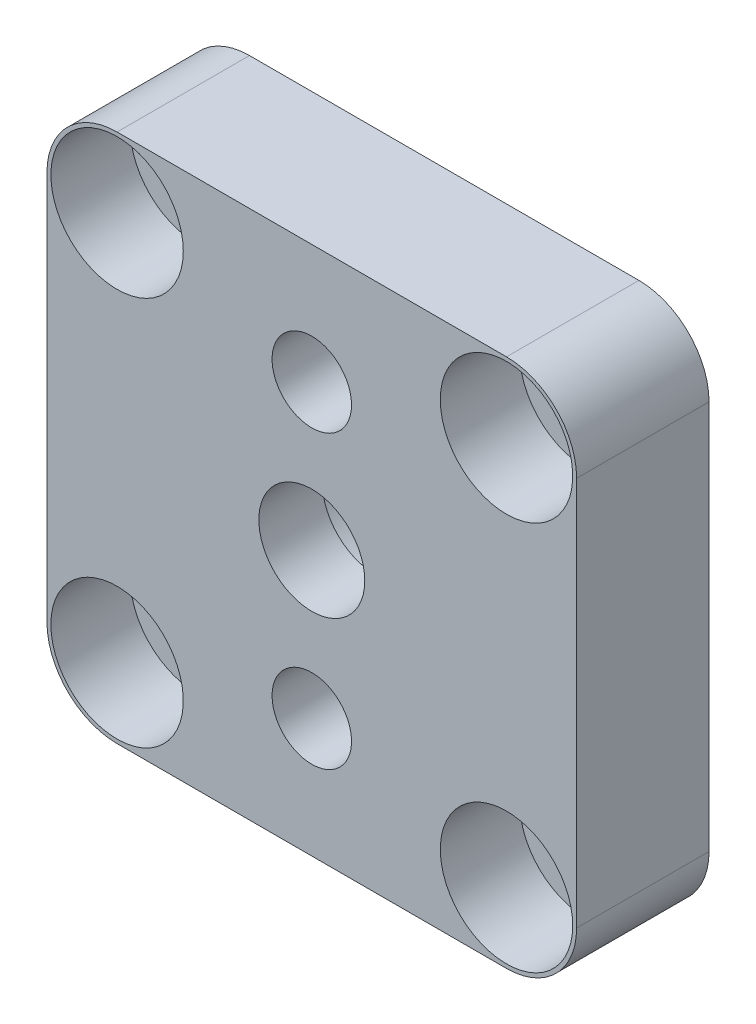
ISO-10303-21;
HEADER;
FILE_DESCRIPTION(('STEP AP214'),'2;1');
FILE_NAME('part.step','',(''),(''),'','','');
FILE_SCHEMA(('AUTOMOTIVE_DESIGN { 1 0 10303 214 1 1 1 1 }'));
ENDSEC;
DATA;
#1=APPLICATION_CONTEXT('core data for automotive mechanical design processes');
#2=APPLICATION_PROTOCOL_DEFINITION('international standard','automotive_design',2000,#1);
#3=PRODUCT_CONTEXT('',#1,'mechanical');
#4=PRODUCT('Part','Part','',(#3));
#5=PRODUCT_RELATED_PRODUCT_CATEGORY('part','',(#4));
#6=PRODUCT_DEFINITION_FORMATION('','',#4);
#7=PRODUCT_DEFINITION_CONTEXT('part definition',#1,'design');
#8=PRODUCT_DEFINITION('design','',#6,#7);
#9=PRODUCT_DEFINITION_SHAPE('','',#8);
#10=(LENGTH_UNIT() NAMED_UNIT(*) SI_UNIT(.MILLI.,.METRE.));
#11=(NAMED_UNIT(*) PLANE_ANGLE_UNIT() SI_UNIT($,.RADIAN.));
#12=(NAMED_UNIT(*) SI_UNIT($,.STERADIAN.) SOLID_ANGLE_UNIT());
#13=UNCERTAINTY_MEASURE_WITH_UNIT(LENGTH_MEASURE(1.E-05),#10,'distance_accuracy_value','');
#14=(GEOMETRIC_REPRESENTATION_CONTEXT(3) GLOBAL_UNCERTAINTY_ASSIGNED_CONTEXT((#13)) GLOBAL_UNIT_ASSIGNED_CONTEXT((#10,
#11,#12)) REPRESENTATION_CONTEXT('',''));
#15=CARTESIAN_POINT('',(0.,0.,0.));
#16=DIRECTION('',(0.,0.,1.));
#17=DIRECTION('',(1.,0.,0.));
#18=AXIS2_PLACEMENT_3D('',#15,#16,#17);
#19=CARTESIAN_POINT('',(-7.35229073212245,7.35229073212245,0.));
#20=DIRECTION('',(0.,0.,1.));
#21=DIRECTION('',(1.,0.,0.));
#22=AXIS2_PLACEMENT_3D('',#19,#20,#21);
#23=CYLINDRICAL_SURFACE('',#22,1.15);
#24=CARTESIAN_POINT('',(-7.35229073212245,7.35229073212245,0.));
#25=DIRECTION('',(0.,0.,1.));
#26=DIRECTION('',(1.,0.,0.));
#27=AXIS2_PLACEMENT_3D('',#24,#25,#26);
#28=CIRCLE('',#27,1.15);
#29=CARTESIAN_POINT('',(-6.20229073212244,7.35229073212245,0.));
#30=VERTEX_POINT('',#29);
#31=EDGE_CURVE('E180',#30,#30,#28,.T.);
#32=ORIENTED_EDGE('',*,*,#31,.F.);
#33=EDGE_LOOP('',(#32));
#34=FACE_BOUND('',#33,.T.);
#35=CARTESIAN_POINT('',(-7.35229073212245,7.35229073212245,2.));
#36=DIRECTION('',(0.,0.,1.));
#37=DIRECTION('',(1.,0.,0.));
#38=AXIS2_PLACEMENT_3D('',#35,#36,#37);
#39=CIRCLE('',#38,1.15);
#40=CARTESIAN_POINT('',(-6.20229073212244,7.35229073212245,2.));
#41=VERTEX_POINT('',#40);
#42=EDGE_CURVE('E41',#41,#41,#39,.F.);
#43=ORIENTED_EDGE('',*,*,#42,.F.);
#44=EDGE_LOOP('',(#43));
#45=FACE_BOUND('',#44,.T.);
#46=ADVANCED_FACE('F37',(#34,#45),#23,.F.);
#47=CARTESIAN_POINT('',(7.35229073212245,-7.35229073212245,0.));
#48=DIRECTION('',(0.,0.,1.));
#49=DIRECTION('',(1.,0.,0.));
#50=AXIS2_PLACEMENT_3D('',#47,#48,#49);
#51=CYLINDRICAL_SURFACE('',#50,1.15);
#52=CARTESIAN_POINT('',(7.35229073212245,-7.35229073212245,0.));
#53=DIRECTION('',(0.,0.,1.));
#54=DIRECTION('',(1.,0.,0.));
#55=AXIS2_PLACEMENT_3D('',#52,#53,#54);
#56=CIRCLE('',#55,1.15);
#57=CARTESIAN_POINT('',(8.50229073212244,-7.35229073212245,0.));
#58=VERTEX_POINT('',#57);
#59=EDGE_CURVE('E171',#58,#58,#56,.T.);
#60=ORIENTED_EDGE('',*,*,#59,.F.);
#61=EDGE_LOOP('',(#60));
#62=FACE_BOUND('',#61,.T.);
#63=CARTESIAN_POINT('',(7.35229073212245,-7.35229073212245,2.));
#64=DIRECTION('',(0.,0.,1.));
#65=DIRECTION('',(1.,0.,0.));
#66=AXIS2_PLACEMENT_3D('',#63,#64,#65);
#67=CIRCLE('',#66,1.15);
#68=CARTESIAN_POINT('',(8.50229073212244,-7.35229073212245,2.));
#69=VERTEX_POINT('',#68);
#70=EDGE_CURVE('E159',#69,#69,#67,.F.);
#71=ORIENTED_EDGE('',*,*,#70,.F.);
#72=EDGE_LOOP('',(#71));
#73=FACE_BOUND('',#72,.T.);
#74=ADVANCED_FACE('F260',(#62,#73),#51,.F.);
#75=CARTESIAN_POINT('',(0.,7.5,0.));
#76=DIRECTION('',(0.,0.,1.));
#77=DIRECTION('',(1.,0.,0.));
#78=AXIS2_PLACEMENT_3D('',#75,#76,#77);
#79=PLANE('',#78);
#80=CARTESIAN_POINT('',(-7.35229073212245,-7.35229073212245,0.));
#81=DIRECTION('',(0.,0.,1.));
#82=DIRECTION('',(-1.,0.,0.));
#83=AXIS2_PLACEMENT_3D('',#80,#81,#82);
#84=CIRCLE('',#83,1.15);
#85=CARTESIAN_POINT('',(-8.50229073212244,-7.35229073212245,0.));
#86=VERTEX_POINT('',#85);
#87=EDGE_CURVE('E167',#86,#86,#84,.T.);
#88=ORIENTED_EDGE('',*,*,#87,.T.);
#89=EDGE_LOOP('',(#88));
#90=FACE_BOUND('',#89,.T.);
#91=ORIENTED_EDGE('',*,*,#59,.T.);
#92=EDGE_LOOP('',(#91));
#93=FACE_BOUND('',#92,.T.);
#94=CARTESIAN_POINT('',(7.35229073212245,7.35229073212245,0.));
#95=DIRECTION('',(0.,0.,1.));
#96=DIRECTION('',(-1.,0.,0.));
#97=AXIS2_PLACEMENT_3D('',#94,#95,#96);
#98=CIRCLE('',#97,1.15);
#99=CARTESIAN_POINT('',(6.20229073212244,7.35229073212245,0.));
#100=VERTEX_POINT('',#99);
#101=EDGE_CURVE('E176',#100,#100,#98,.T.);
#102=ORIENTED_EDGE('',*,*,#101,.T.);
#103=EDGE_LOOP('',(#102));
#104=FACE_BOUND('',#103,.T.);
#105=ORIENTED_EDGE('',*,*,#31,.T.);
#106=EDGE_LOOP('',(#105));
#107=FACE_BOUND('',#106,.T.);
#108=CARTESIAN_POINT('',(0.,5.5,0.));
#109=DIRECTION('',(0.,0.,1.));
#110=DIRECTION('',(1.,0.,0.));
#111=AXIS2_PLACEMENT_3D('',#108,#109,#110);
#112=CIRCLE('',#111,1.05);
#113=CARTESIAN_POINT('',(1.05,5.5,0.));
#114=VERTEX_POINT('',#113);
#115=EDGE_CURVE('E223',#114,#114,#112,.T.);
#116=ORIENTED_EDGE('',*,*,#115,.T.);
#117=EDGE_LOOP('',(#116));
#118=FACE_BOUND('',#117,.T.);
#119=CARTESIAN_POINT('',(0.,-5.5,0.));
#120=DIRECTION('',(0.,0.,1.));
#121=DIRECTION('',(-1.,0.,0.));
#122=AXIS2_PLACEMENT_3D('',#119,#120,#121);
#123=CIRCLE('',#122,1.05);
#124=CARTESIAN_POINT('',(-1.05,-5.5,0.));
#125=VERTEX_POINT('',#124);
#126=EDGE_CURVE('E155',#125,#125,#123,.T.);
#127=ORIENTED_EDGE('',*,*,#126,.T.);
#128=EDGE_LOOP('',(#127));
#129=FACE_BOUND('',#128,.T.);
#130=CARTESIAN_POINT('',(0.,0.,0.));
#131=DIRECTION('',(0.,0.,1.));
#132=DIRECTION('',(1.,0.,0.));
#133=AXIS2_PLACEMENT_3D('',#130,#131,#132);
#134=CIRCLE('',#133,3.75);
#135=CARTESIAN_POINT('',(3.75,0.,0.));
#136=VERTEX_POINT('',#135);
#137=EDGE_CURVE('E11',#136,#136,#134,.T.);
#138=ORIENTED_EDGE('',*,*,#137,.T.);
#139=EDGE_LOOP('',(#138));
#140=FACE_BOUND('',#139,.T.);
#141=DIRECTION('',(1.,0.,0.));
#142=VECTOR('',#141,1.);
#143=CARTESIAN_POINT('',(10.,-10.,0.));
#144=LINE('',#143,#142);
#145=CARTESIAN_POINT('',(-7.35229073212245,-10.,0.));
#146=VERTEX_POINT('',#145);
#147=CARTESIAN_POINT('',(7.35229073212244,-10.,0.));
#148=VERTEX_POINT('',#147);
#149=EDGE_CURVE('E127',#146,#148,#144,.T.);
#150=ORIENTED_EDGE('',*,*,#149,.F.);
#151=CARTESIAN_POINT('',(-7.35229073212245,-7.35229073212245,0.));
#152=DIRECTION('',(0.,0.,-1.));
#153=DIRECTION('',(1.,0.,0.));
#154=AXIS2_PLACEMENT_3D('',#151,#152,#153);
#155=CIRCLE('',#154,2.64770926787756);
#156=CARTESIAN_POINT('',(-10.,-7.35229073212245,0.));
#157=VERTEX_POINT('',#156);
#158=EDGE_CURVE('E199',#146,#157,#155,.T.);
#159=ORIENTED_EDGE('',*,*,#158,.T.);
#160=DIRECTION('',(0.,-1.,0.));
#161=VECTOR('',#160,1.);
#162=CARTESIAN_POINT('',(-10.,-10.,0.));
#163=LINE('',#162,#161);
#164=CARTESIAN_POINT('',(-10.,7.35229073212245,0.));
#165=VERTEX_POINT('',#164);
#166=EDGE_CURVE('E124',#165,#157,#163,.T.);
#167=ORIENTED_EDGE('',*,*,#166,.F.);
#168=CARTESIAN_POINT('',(-7.35229073212245,7.35229073212245,0.));
#169=DIRECTION('',(0.,0.,-1.));
#170=DIRECTION('',(-1.,0.,0.));
#171=AXIS2_PLACEMENT_3D('',#168,#169,#170);
#172=CIRCLE('',#171,2.64770926787756);
#173=CARTESIAN_POINT('',(-7.35229073212245,10.,0.));
#174=VERTEX_POINT('',#173);
#175=EDGE_CURVE('E205',#165,#174,#172,.T.);
#176=ORIENTED_EDGE('',*,*,#175,.T.);
#177=DIRECTION('',(-1.,0.,0.));
#178=VECTOR('',#177,1.);
#179=CARTESIAN_POINT('',(10.,10.,0.));
#180=LINE('',#179,#178);
#181=CARTESIAN_POINT('',(7.35229073212244,10.,0.));
#182=VERTEX_POINT('',#181);
#183=EDGE_CURVE('E137',#182,#174,#180,.T.);
#184=ORIENTED_EDGE('',*,*,#183,.F.);
#185=CARTESIAN_POINT('',(7.35229073212244,7.35229073212245,0.));
#186=DIRECTION('',(0.,0.,-1.));
#187=DIRECTION('',(1.,0.,0.));
#188=AXIS2_PLACEMENT_3D('',#185,#186,#187);
#189=CIRCLE('',#188,2.64770926787756);
#190=CARTESIAN_POINT('',(10.,7.35229073212245,0.));
#191=VERTEX_POINT('',#190);
#192=EDGE_CURVE('E105',#182,#191,#189,.T.);
#193=ORIENTED_EDGE('',*,*,#192,.T.);
#194=DIRECTION('',(0.,1.,0.));
#195=VECTOR('',#194,1.);
#196=CARTESIAN_POINT('',(10.,-10.,0.));
#197=LINE('',#196,#195);
#198=CARTESIAN_POINT('',(10.,-7.35229073212245,0.));
#199=VERTEX_POINT('',#198);
#200=EDGE_CURVE('E231',#199,#191,#197,.T.);
#201=ORIENTED_EDGE('',*,*,#200,.F.);
#202=CARTESIAN_POINT('',(7.35229073212244,-7.35229073212245,0.));
#203=DIRECTION('',(0.,0.,-1.));
#204=DIRECTION('',(-1.,0.,0.));
#205=AXIS2_PLACEMENT_3D('',#202,#203,#204);
#206=CIRCLE('',#205,2.64770926787756);
#207=EDGE_CURVE('E189',#199,#148,#206,.T.);
#208=ORIENTED_EDGE('',*,*,#207,.T.);
#209=EDGE_LOOP('',(#150,#159,#167,#176,#184,#193,#201,#208));
#210=FACE_BOUND('',#209,.T.);
#211=ADVANCED_FACE('F39',(#90,#93,#104,#107,#118,#129,#140,#210),#79,.F.);
#212=CARTESIAN_POINT('',(0.,2.,5.));
#213=DIRECTION('',(0.,0.,-1.));
#214=DIRECTION('',(-1.,0.,0.));
#215=AXIS2_PLACEMENT_3D('',#212,#213,#214);
#216=PLANE('',#215);
#217=CARTESIAN_POINT('',(-7.35229073212245,-7.35229073212244,5.));
#218=DIRECTION('',(0.,0.,1.));
#219=DIRECTION('',(-1.,0.,0.));
#220=AXIS2_PLACEMENT_3D('',#217,#218,#219);
#221=CIRCLE('',#220,2.5);
#222=CARTESIAN_POINT('',(-9.85229073212245,-7.35229073212244,5.));
#223=VERTEX_POINT('',#222);
#224=EDGE_CURVE('E577',#223,#223,#221,.T.);
#225=ORIENTED_EDGE('',*,*,#224,.F.);
#226=EDGE_LOOP('',(#225));
#227=FACE_BOUND('',#226,.T.);
#228=CARTESIAN_POINT('',(7.35229073212243,-7.35229073212246,5.));
#229=DIRECTION('',(0.,0.,1.));
#230=DIRECTION('',(1.,0.,0.));
#231=AXIS2_PLACEMENT_3D('',#228,#229,#230);
#232=CIRCLE('',#231,2.5);
#233=CARTESIAN_POINT('',(9.85229073212243,-7.35229073212246,5.));
#234=VERTEX_POINT('',#233);
#235=EDGE_CURVE('E583',#234,#234,#232,.T.);
#236=ORIENTED_EDGE('',*,*,#235,.F.);
#237=EDGE_LOOP('',(#236));
#238=FACE_BOUND('',#237,.T.);
#239=CARTESIAN_POINT('',(7.35229073212243,7.35229073212246,5.));
#240=DIRECTION('',(0.,0.,1.));
#241=DIRECTION('',(-1.,0.,0.));
#242=AXIS2_PLACEMENT_3D('',#239,#240,#241);
#243=CIRCLE('',#242,2.5);
#244=CARTESIAN_POINT('',(4.85229073212244,7.35229073212246,5.));
#245=VERTEX_POINT('',#244);
#246=EDGE_CURVE('E557',#245,#245,#243,.T.);
#247=ORIENTED_EDGE('',*,*,#246,.F.);
#248=EDGE_LOOP('',(#247));
#249=FACE_BOUND('',#248,.T.);
#250=CARTESIAN_POINT('',(-7.35229073212245,7.35229073212245,5.));
#251=DIRECTION('',(0.,0.,1.));
#252=DIRECTION('',(1.,0.,0.));
#253=AXIS2_PLACEMENT_3D('',#250,#251,#252);
#254=CIRCLE('',#253,2.5);
#255=CARTESIAN_POINT('',(-4.85229073212244,7.35229073212245,5.));
#256=VERTEX_POINT('',#255);
#257=EDGE_CURVE('E555',#256,#256,#254,.T.);
#258=ORIENTED_EDGE('',*,*,#257,.F.);
#259=EDGE_LOOP('',(#258));
#260=FACE_BOUND('',#259,.T.);
#261=CARTESIAN_POINT('',(0.,5.5,5.));
#262=DIRECTION('',(0.,0.,1.));
#263=DIRECTION('',(1.,0.,0.));
#264=AXIS2_PLACEMENT_3D('',#261,#262,#263);
#265=CIRCLE('',#264,1.5);
#266=CARTESIAN_POINT('',(1.5,5.5,5.));
#267=VERTEX_POINT('',#266);
#268=EDGE_CURVE('E215',#267,#267,#265,.T.);
#269=ORIENTED_EDGE('',*,*,#268,.F.);
#270=EDGE_LOOP('',(#269));
#271=FACE_BOUND('',#270,.T.);
#272=CARTESIAN_POINT('',(0.,-5.5,5.));
#273=DIRECTION('',(0.,0.,1.));
#274=DIRECTION('',(-1.,0.,0.));
#275=AXIS2_PLACEMENT_3D('',#272,#273,#274);
#276=CIRCLE('',#275,1.5);
#277=CARTESIAN_POINT('',(-1.5,-5.5,5.));
#278=VERTEX_POINT('',#277);
#279=EDGE_CURVE('E218',#278,#278,#276,.T.);
#280=ORIENTED_EDGE('',*,*,#279,.F.);
#281=EDGE_LOOP('',(#280));
#282=FACE_BOUND('',#281,.T.);
#283=CARTESIAN_POINT('',(0.,0.,5.));
#284=DIRECTION('',(0.,0.,1.));
#285=DIRECTION('',(1.,0.,0.));
#286=AXIS2_PLACEMENT_3D('',#283,#284,#285);
#287=CIRCLE('',#286,2.);
#288=CARTESIAN_POINT('',(2.,0.,5.));
#289=VERTEX_POINT('',#288);
#290=EDGE_CURVE('E133',#289,#289,#287,.T.);
#291=ORIENTED_EDGE('',*,*,#290,.F.);
#292=EDGE_LOOP('',(#291));
#293=FACE_BOUND('',#292,.T.);
#294=DIRECTION('',(0.,-1.,0.));
#295=VECTOR('',#294,1.);
#296=CARTESIAN_POINT('',(-10.,-10.,5.));
#297=LINE('',#296,#295);
#298=CARTESIAN_POINT('',(-10.,7.35229073212245,5.));
#299=VERTEX_POINT('',#298);
#300=CARTESIAN_POINT('',(-10.,-7.35229073212245,5.));
#301=VERTEX_POINT('',#300);
#302=EDGE_CURVE('E226',#299,#301,#297,.T.);
#303=ORIENTED_EDGE('',*,*,#302,.T.);
#304=CARTESIAN_POINT('',(-7.35229073212245,-7.35229073212245,5.));
#305=DIRECTION('',(0.,0.,-1.));
#306=DIRECTION('',(1.,0.,0.));
#307=AXIS2_PLACEMENT_3D('',#304,#305,#306);
#308=CIRCLE('',#307,2.64770926787756);
#309=CARTESIAN_POINT('',(-7.35229073212245,-10.,5.));
#310=VERTEX_POINT('',#309);
#311=EDGE_CURVE('E193',#310,#301,#308,.T.);
#312=ORIENTED_EDGE('',*,*,#311,.F.);
#313=DIRECTION('',(1.,0.,0.));
#314=VECTOR('',#313,1.);
#315=CARTESIAN_POINT('',(10.,-10.,5.));
#316=LINE('',#315,#314);
#317=CARTESIAN_POINT('',(7.35229073212244,-10.,5.));
#318=VERTEX_POINT('',#317);
#319=EDGE_CURVE('E129',#310,#318,#316,.T.);
#320=ORIENTED_EDGE('',*,*,#319,.T.);
#321=CARTESIAN_POINT('',(7.35229073212244,-7.35229073212245,5.));
#322=DIRECTION('',(0.,0.,-1.));
#323=DIRECTION('',(-1.,0.,0.));
#324=AXIS2_PLACEMENT_3D('',#321,#322,#323);
#325=CIRCLE('',#324,2.64770926787756);
#326=CARTESIAN_POINT('',(10.,-7.35229073212245,5.));
#327=VERTEX_POINT('',#326);
#328=EDGE_CURVE('E184',#327,#318,#325,.T.);
#329=ORIENTED_EDGE('',*,*,#328,.F.);
#330=DIRECTION('',(0.,1.,0.));
#331=VECTOR('',#330,1.);
#332=CARTESIAN_POINT('',(10.,-10.,5.));
#333=LINE('',#332,#331);
#334=CARTESIAN_POINT('',(10.,7.35229073212245,5.));
#335=VERTEX_POINT('',#334);
#336=EDGE_CURVE('E120',#327,#335,#333,.T.);
#337=ORIENTED_EDGE('',*,*,#336,.T.);
#338=CARTESIAN_POINT('',(7.35229073212244,7.35229073212245,5.));
#339=DIRECTION('',(0.,0.,-1.));
#340=DIRECTION('',(1.,0.,0.));
#341=AXIS2_PLACEMENT_3D('',#338,#339,#340);
#342=CIRCLE('',#341,2.64770926787756);
#343=CARTESIAN_POINT('',(7.35229073212244,10.,5.));
#344=VERTEX_POINT('',#343);
#345=EDGE_CURVE('E62',#344,#335,#342,.T.);
#346=ORIENTED_EDGE('',*,*,#345,.F.);
#347=DIRECTION('',(-1.,0.,0.));
#348=VECTOR('',#347,1.);
#349=CARTESIAN_POINT('',(10.,10.,5.));
#350=LINE('',#349,#348);
#351=CARTESIAN_POINT('',(-7.35229073212245,10.,5.));
#352=VERTEX_POINT('',#351);
#353=EDGE_CURVE('E117',#344,#352,#350,.T.);
#354=ORIENTED_EDGE('',*,*,#353,.T.);
#355=CARTESIAN_POINT('',(-7.35229073212245,7.35229073212245,5.));
#356=DIRECTION('',(0.,0.,-1.));
#357=DIRECTION('',(-1.,0.,0.));
#358=AXIS2_PLACEMENT_3D('',#355,#356,#357);
#359=CIRCLE('',#358,2.64770926787756);
#360=EDGE_CURVE('E54',#299,#352,#359,.T.);
#361=ORIENTED_EDGE('',*,*,#360,.F.);
#362=EDGE_LOOP('',(#303,#312,#320,#329,#337,#346,#354,#361));
#363=FACE_BOUND('',#362,.T.);
#364=ADVANCED_FACE('F116',(#227,#238,#249,#260,#271,#282,#293,#363),#216,.F.);
#365=CARTESIAN_POINT('',(0.,5.5,0.));
#366=DIRECTION('',(0.,0.,1.));
#367=DIRECTION('',(1.,0.,0.));
#368=AXIS2_PLACEMENT_3D('',#365,#366,#367);
#369=CYLINDRICAL_SURFACE('',#368,1.05);
#370=ORIENTED_EDGE('',*,*,#115,.F.);
#371=EDGE_LOOP('',(#370));
#372=FACE_BOUND('',#371,.T.);
#373=CARTESIAN_POINT('',(0.,5.5,2.5));
#374=DIRECTION('',(0.,0.,1.));
#375=DIRECTION('',(1.,0.,0.));
#376=AXIS2_PLACEMENT_3D('',#373,#374,#375);
#377=CIRCLE('',#376,1.05);
#378=CARTESIAN_POINT('',(1.05,5.5,2.5));
#379=VERTEX_POINT('',#378);
#380=EDGE_CURVE('E148',#379,#379,#377,.F.);
#381=ORIENTED_EDGE('',*,*,#380,.F.);
#382=EDGE_LOOP('',(#381));
#383=FACE_BOUND('',#382,.T.);
#384=ADVANCED_FACE('F301',(#372,#383),#369,.F.);
#385=CARTESIAN_POINT('',(0.,0.,12.6));
#386=DIRECTION('',(0.,0.,1.));
#387=DIRECTION('',(1.,0.,0.));
#388=AXIS2_PLACEMENT_3D('',#385,#386,#387);
#389=CYLINDRICAL_SURFACE('',#388,3.75);
#390=ORIENTED_EDGE('',*,*,#137,.F.);
#391=EDGE_LOOP('',(#390));
#392=FACE_BOUND('',#391,.T.);
#393=CARTESIAN_POINT('',(0.,0.,1.));
#394=DIRECTION('',(0.,0.,1.));
#395=DIRECTION('',(1.,0.,0.));
#396=AXIS2_PLACEMENT_3D('',#393,#394,#395);
#397=CIRCLE('',#396,3.75);
#398=CARTESIAN_POINT('',(3.75,0.,1.));
#399=VERTEX_POINT('',#398);
#400=EDGE_CURVE('E46',#399,#399,#397,.T.);
#401=ORIENTED_EDGE('',*,*,#400,.T.);
#402=EDGE_LOOP('',(#401));
#403=FACE_BOUND('',#402,.T.);
#404=ADVANCED_FACE('F304',(#392,#403),#389,.F.);
#405=CARTESIAN_POINT('',(0.,3.75,1.));
#406=DIRECTION('',(0.,0.,1.));
#407=DIRECTION('',(1.,0.,0.));
#408=AXIS2_PLACEMENT_3D('',#405,#406,#407);
#409=PLANE('',#408);
#410=ORIENTED_EDGE('',*,*,#400,.F.);
#411=EDGE_LOOP('',(#410));
#412=FACE_BOUND('',#411,.T.);
#413=CARTESIAN_POINT('',(0.,0.,1.));
#414=DIRECTION('',(0.,0.,1.));
#415=DIRECTION('',(1.,0.,0.));
#416=AXIS2_PLACEMENT_3D('',#413,#414,#415);
#417=CIRCLE('',#416,3.25);
#418=CARTESIAN_POINT('',(3.25,0.,1.));
#419=VERTEX_POINT('',#418);
#420=EDGE_CURVE('E143',#419,#419,#417,.T.);
#421=ORIENTED_EDGE('',*,*,#420,.T.);
#422=EDGE_LOOP('',(#421));
#423=FACE_BOUND('',#422,.T.);
#424=ADVANCED_FACE('F320',(#412,#423),#409,.F.);
#425=CARTESIAN_POINT('',(0.,0.,12.6));
#426=DIRECTION('',(0.,0.,1.));
#427=DIRECTION('',(1.,0.,0.));
#428=AXIS2_PLACEMENT_3D('',#425,#426,#427);
#429=CYLINDRICAL_SURFACE('',#428,3.25);
#430=ORIENTED_EDGE('',*,*,#420,.F.);
#431=EDGE_LOOP('',(#430));
#432=FACE_BOUND('',#431,.T.);
#433=CARTESIAN_POINT('',(0.,0.,2.6));
#434=DIRECTION('',(0.,0.,1.));
#435=DIRECTION('',(1.,0.,0.));
#436=AXIS2_PLACEMENT_3D('',#433,#434,#435);
#437=CIRCLE('',#436,3.25);
#438=CARTESIAN_POINT('',(3.25,0.,2.6));
#439=VERTEX_POINT('',#438);
#440=EDGE_CURVE('E140',#439,#439,#437,.T.);
#441=ORIENTED_EDGE('',*,*,#440,.T.);
#442=EDGE_LOOP('',(#441));
#443=FACE_BOUND('',#442,.T.);
#444=ADVANCED_FACE('F325',(#432,#443),#429,.F.);
#445=CARTESIAN_POINT('',(0.,3.25,2.6));
#446=DIRECTION('',(0.,0.,1.));
#447=DIRECTION('',(1.,0.,0.));
#448=AXIS2_PLACEMENT_3D('',#445,#446,#447);
#449=PLANE('',#448);
#450=ORIENTED_EDGE('',*,*,#440,.F.);
#451=EDGE_LOOP('',(#450));
#452=FACE_BOUND('',#451,.T.);
#453=CARTESIAN_POINT('',(0.,0.,2.6));
#454=DIRECTION('',(0.,0.,1.));
#455=DIRECTION('',(1.,0.,0.));
#456=AXIS2_PLACEMENT_3D('',#453,#454,#455);
#457=CIRCLE('',#456,2.);
#458=CARTESIAN_POINT('',(2.,0.,2.6));
#459=VERTEX_POINT('',#458);
#460=EDGE_CURVE('E136',#459,#459,#457,.T.);
#461=ORIENTED_EDGE('',*,*,#460,.T.);
#462=EDGE_LOOP('',(#461));
#463=FACE_BOUND('',#462,.T.);
#464=ADVANCED_FACE('F331',(#452,#463),#449,.F.);
#465=CARTESIAN_POINT('',(0.,0.,12.6));
#466=DIRECTION('',(0.,0.,1.));
#467=DIRECTION('',(1.,0.,0.));
#468=AXIS2_PLACEMENT_3D('',#465,#466,#467);
#469=CYLINDRICAL_SURFACE('',#468,2.);
#470=ORIENTED_EDGE('',*,*,#460,.F.);
#471=EDGE_LOOP('',(#470));
#472=FACE_BOUND('',#471,.T.);
#473=ORIENTED_EDGE('',*,*,#290,.T.);
#474=EDGE_LOOP('',(#473));
#475=FACE_BOUND('',#474,.T.);
#476=ADVANCED_FACE('F337',(#472,#475),#469,.F.);
#477=CARTESIAN_POINT('',(-10.,-10.,0.));
#478=DIRECTION('',(-1.,0.,0.));
#479=DIRECTION('',(0.,0.,1.));
#480=AXIS2_PLACEMENT_3D('',#477,#478,#479);
#481=PLANE('',#480);
#482=DIRECTION('',(0.,0.,1.));
#483=VECTOR('',#482,1.);
#484=CARTESIAN_POINT('',(-10.,-7.35229073212245,0.));
#485=LINE('',#484,#483);
#486=EDGE_CURVE('E182',#157,#301,#485,.T.);
#487=ORIENTED_EDGE('',*,*,#486,.T.);
#488=ORIENTED_EDGE('',*,*,#302,.F.);
#489=DIRECTION('',(0.,0.,1.));
#490=VECTOR('',#489,1.);
#491=CARTESIAN_POINT('',(-10.,7.35229073212245,0.));
#492=LINE('',#491,#490);
#493=EDGE_CURVE('E209',#165,#299,#492,.T.);
#494=ORIENTED_EDGE('',*,*,#493,.F.);
#495=ORIENTED_EDGE('',*,*,#166,.T.);
#496=EDGE_LOOP('',(#487,#488,#494,#495));
#497=FACE_BOUND('',#496,.T.);
#498=ADVANCED_FACE('F257',(#497),#481,.T.);
#499=CARTESIAN_POINT('',(10.,10.,0.));
#500=DIRECTION('',(0.,1.,0.));
#501=DIRECTION('',(0.,0.,1.));
#502=AXIS2_PLACEMENT_3D('',#499,#500,#501);
#503=PLANE('',#502);
#504=DIRECTION('',(0.,0.,1.));
#505=VECTOR('',#504,1.);
#506=CARTESIAN_POINT('',(7.35229073212244,10.,0.));
#507=LINE('',#506,#505);
#508=EDGE_CURVE('E102',#182,#344,#507,.T.);
#509=ORIENTED_EDGE('',*,*,#508,.F.);
#510=ORIENTED_EDGE('',*,*,#183,.T.);
#511=DIRECTION('',(0.,0.,1.));
#512=VECTOR('',#511,1.);
#513=CARTESIAN_POINT('',(-7.35229073212245,10.,0.));
#514=LINE('',#513,#512);
#515=EDGE_CURVE('E123',#174,#352,#514,.T.);
#516=ORIENTED_EDGE('',*,*,#515,.T.);
#517=ORIENTED_EDGE('',*,*,#353,.F.);
#518=EDGE_LOOP('',(#509,#510,#516,#517));
#519=FACE_BOUND('',#518,.T.);
#520=ADVANCED_FACE('F122',(#519),#503,.T.);
#521=CARTESIAN_POINT('',(10.,-10.,0.));
#522=DIRECTION('',(1.,0.,0.));
#523=DIRECTION('',(0.,0.,-1.));
#524=AXIS2_PLACEMENT_3D('',#521,#522,#523);
#525=PLANE('',#524);
#526=DIRECTION('',(0.,0.,1.));
#527=VECTOR('',#526,1.);
#528=CARTESIAN_POINT('',(10.,-7.35229073212245,0.));
#529=LINE('',#528,#527);
#530=EDGE_CURVE('E187',#199,#327,#529,.T.);
#531=ORIENTED_EDGE('',*,*,#530,.F.);
#532=ORIENTED_EDGE('',*,*,#200,.T.);
#533=DIRECTION('',(0.,0.,1.));
#534=VECTOR('',#533,1.);
#535=CARTESIAN_POINT('',(10.,7.35229073212245,0.));
#536=LINE('',#535,#534);
#537=EDGE_CURVE('E110',#191,#335,#536,.T.);
#538=ORIENTED_EDGE('',*,*,#537,.T.);
#539=ORIENTED_EDGE('',*,*,#336,.F.);
#540=EDGE_LOOP('',(#531,#532,#538,#539));
#541=FACE_BOUND('',#540,.T.);
#542=ADVANCED_FACE('F248',(#541),#525,.T.);
#543=CARTESIAN_POINT('',(10.,-10.,0.));
#544=DIRECTION('',(0.,-1.,0.));
#545=DIRECTION('',(0.,0.,-1.));
#546=AXIS2_PLACEMENT_3D('',#543,#544,#545);
#547=PLANE('',#546);
#548=DIRECTION('',(0.,0.,1.));
#549=VECTOR('',#548,1.);
#550=CARTESIAN_POINT('',(-7.35229073212245,-10.,0.));
#551=LINE('',#550,#549);
#552=EDGE_CURVE('E197',#146,#310,#551,.T.);
#553=ORIENTED_EDGE('',*,*,#552,.F.);
#554=ORIENTED_EDGE('',*,*,#149,.T.);
#555=DIRECTION('',(0.,0.,1.));
#556=VECTOR('',#555,1.);
#557=CARTESIAN_POINT('',(7.35229073212244,-10.,0.));
#558=LINE('',#557,#556);
#559=EDGE_CURVE('E190',#148,#318,#558,.T.);
#560=ORIENTED_EDGE('',*,*,#559,.T.);
#561=ORIENTED_EDGE('',*,*,#319,.F.);
#562=EDGE_LOOP('',(#553,#554,#560,#561));
#563=FACE_BOUND('',#562,.T.);
#564=ADVANCED_FACE('F240',(#563),#547,.T.);
#565=CARTESIAN_POINT('',(0.,-5.5,0.));
#566=DIRECTION('',(0.,0.,1.));
#567=DIRECTION('',(1.,0.,0.));
#568=AXIS2_PLACEMENT_3D('',#565,#566,#567);
#569=CYLINDRICAL_SURFACE('',#568,1.05);
#570=CARTESIAN_POINT('',(0.,-5.5,2.5));
#571=DIRECTION('',(0.,0.,-1.));
#572=DIRECTION('',(-1.,0.,0.));
#573=AXIS2_PLACEMENT_3D('',#570,#571,#572);
#574=CIRCLE('',#573,1.05);
#575=CARTESIAN_POINT('',(-1.05,-5.5,2.5));
#576=VERTEX_POINT('',#575);
#577=EDGE_CURVE('E151',#576,#576,#574,.F.);
#578=ORIENTED_EDGE('',*,*,#577,.T.);
#579=EDGE_LOOP('',(#578));
#580=FACE_BOUND('',#579,.T.);
#581=ORIENTED_EDGE('',*,*,#126,.F.);
#582=EDGE_LOOP('',(#581));
#583=FACE_BOUND('',#582,.T.);
#584=ADVANCED_FACE('F255',(#580,#583),#569,.F.);
#585=CARTESIAN_POINT('',(0.,5.5,2.5));
#586=DIRECTION('',(0.,0.,1.));
#587=DIRECTION('',(1.,0.,0.));
#588=AXIS2_PLACEMENT_3D('',#585,#586,#587);
#589=PLANE('',#588);
#590=CARTESIAN_POINT('',(0.,5.5,2.5));
#591=DIRECTION('',(0.,0.,1.));
#592=DIRECTION('',(1.,0.,0.));
#593=AXIS2_PLACEMENT_3D('',#590,#591,#592);
#594=CIRCLE('',#593,1.5);
#595=CARTESIAN_POINT('',(1.5,5.5,2.5));
#596=VERTEX_POINT('',#595);
#597=EDGE_CURVE('E152',#596,#596,#594,.T.);
#598=ORIENTED_EDGE('',*,*,#597,.T.);
#599=EDGE_LOOP('',(#598));
#600=FACE_BOUND('',#599,.T.);
#601=ORIENTED_EDGE('',*,*,#380,.T.);
#602=EDGE_LOOP('',(#601));
#603=FACE_BOUND('',#602,.T.);
#604=ADVANCED_FACE('F286',(#600,#603),#589,.T.);
#605=CARTESIAN_POINT('',(0.,5.5,2.5));
#606=DIRECTION('',(0.,0.,1.));
#607=DIRECTION('',(1.,0.,0.));
#608=AXIS2_PLACEMENT_3D('',#605,#606,#607);
#609=CYLINDRICAL_SURFACE('',#608,1.5);
#610=ORIENTED_EDGE('',*,*,#597,.F.);
#611=EDGE_LOOP('',(#610));
#612=FACE_BOUND('',#611,.T.);
#613=ORIENTED_EDGE('',*,*,#268,.T.);
#614=EDGE_LOOP('',(#613));
#615=FACE_BOUND('',#614,.T.);
#616=ADVANCED_FACE('F289',(#612,#615),#609,.F.);
#617=CARTESIAN_POINT('',(0.,-5.5,2.5));
#618=DIRECTION('',(0.,0.,-1.));
#619=DIRECTION('',(-1.,0.,0.));
#620=AXIS2_PLACEMENT_3D('',#617,#618,#619);
#621=PLANE('',#620);
#622=CARTESIAN_POINT('',(0.,-5.5,2.5));
#623=DIRECTION('',(0.,0.,1.));
#624=DIRECTION('',(-1.,0.,0.));
#625=AXIS2_PLACEMENT_3D('',#622,#623,#624);
#626=CIRCLE('',#625,1.5);
#627=CARTESIAN_POINT('',(-1.5,-5.5,2.5));
#628=VERTEX_POINT('',#627);
#629=EDGE_CURVE('E211',#628,#628,#626,.T.);
#630=ORIENTED_EDGE('',*,*,#629,.T.);
#631=EDGE_LOOP('',(#630));
#632=FACE_BOUND('',#631,.T.);
#633=ORIENTED_EDGE('',*,*,#577,.F.);
#634=EDGE_LOOP('',(#633));
#635=FACE_BOUND('',#634,.T.);
#636=ADVANCED_FACE('F293',(#632,#635),#621,.F.);
#637=CARTESIAN_POINT('',(0.,-5.5,2.5));
#638=DIRECTION('',(0.,0.,1.));
#639=DIRECTION('',(1.,0.,0.));
#640=AXIS2_PLACEMENT_3D('',#637,#638,#639);
#641=CYLINDRICAL_SURFACE('',#640,1.5);
#642=ORIENTED_EDGE('',*,*,#629,.F.);
#643=EDGE_LOOP('',(#642));
#644=FACE_BOUND('',#643,.T.);
#645=ORIENTED_EDGE('',*,*,#279,.T.);
#646=EDGE_LOOP('',(#645));
#647=FACE_BOUND('',#646,.T.);
#648=ADVANCED_FACE('F279',(#644,#647),#641,.F.);
#649=CARTESIAN_POINT('',(7.35229073212244,-7.35229073212245,0.));
#650=DIRECTION('',(0.,0.,1.));
#651=DIRECTION('',(1.,0.,0.));
#652=AXIS2_PLACEMENT_3D('',#649,#650,#651);
#653=CYLINDRICAL_SURFACE('',#652,2.64770926787756);
#654=ORIENTED_EDGE('',*,*,#328,.T.);
#655=ORIENTED_EDGE('',*,*,#559,.F.);
#656=ORIENTED_EDGE('',*,*,#207,.F.);
#657=ORIENTED_EDGE('',*,*,#530,.T.);
#658=EDGE_LOOP('',(#654,#655,#656,#657));
#659=FACE_BOUND('',#658,.T.);
#660=ADVANCED_FACE('F243',(#659),#653,.T.);
#661=CARTESIAN_POINT('',(-7.35229073212245,-7.35229073212245,0.));
#662=DIRECTION('',(0.,0.,1.));
#663=DIRECTION('',(1.,0.,0.));
#664=AXIS2_PLACEMENT_3D('',#661,#662,#663);
#665=CYLINDRICAL_SURFACE('',#664,2.64770926787756);
#666=ORIENTED_EDGE('',*,*,#311,.T.);
#667=ORIENTED_EDGE('',*,*,#486,.F.);
#668=ORIENTED_EDGE('',*,*,#158,.F.);
#669=ORIENTED_EDGE('',*,*,#552,.T.);
#670=EDGE_LOOP('',(#666,#667,#668,#669));
#671=FACE_BOUND('',#670,.T.);
#672=ADVANCED_FACE('F276',(#671),#665,.T.);
#673=CARTESIAN_POINT('',(7.35229073212244,7.35229073212245,0.));
#674=DIRECTION('',(0.,0.,1.));
#675=DIRECTION('',(1.,0.,0.));
#676=AXIS2_PLACEMENT_3D('',#673,#674,#675);
#677=CYLINDRICAL_SURFACE('',#676,2.64770926787756);
#678=ORIENTED_EDGE('',*,*,#345,.T.);
#679=ORIENTED_EDGE('',*,*,#537,.F.);
#680=ORIENTED_EDGE('',*,*,#192,.F.);
#681=ORIENTED_EDGE('',*,*,#508,.T.);
#682=EDGE_LOOP('',(#678,#679,#680,#681));
#683=FACE_BOUND('',#682,.T.);
#684=ADVANCED_FACE('F103',(#683),#677,.T.);
#685=CARTESIAN_POINT('',(-7.35229073212245,7.35229073212245,0.));
#686=DIRECTION('',(0.,0.,1.));
#687=DIRECTION('',(1.,0.,0.));
#688=AXIS2_PLACEMENT_3D('',#685,#686,#687);
#689=CYLINDRICAL_SURFACE('',#688,2.64770926787756);
#690=ORIENTED_EDGE('',*,*,#360,.T.);
#691=ORIENTED_EDGE('',*,*,#515,.F.);
#692=ORIENTED_EDGE('',*,*,#175,.F.);
#693=ORIENTED_EDGE('',*,*,#493,.T.);
#694=EDGE_LOOP('',(#690,#691,#692,#693));
#695=FACE_BOUND('',#694,.T.);
#696=ADVANCED_FACE('F275',(#695),#689,.T.);
#697=CARTESIAN_POINT('',(7.35229073212245,7.35229073212245,0.));
#698=DIRECTION('',(0.,0.,1.));
#699=DIRECTION('',(1.,0.,0.));
#700=AXIS2_PLACEMENT_3D('',#697,#698,#699);
#701=CYLINDRICAL_SURFACE('',#700,1.15);
#702=CARTESIAN_POINT('',(7.35229073212245,7.35229073212245,2.));
#703=DIRECTION('',(0.,0.,-1.));
#704=DIRECTION('',(-1.,0.,0.));
#705=AXIS2_PLACEMENT_3D('',#702,#703,#704);
#706=CIRCLE('',#705,1.15);
#707=CARTESIAN_POINT('',(6.20229073212244,7.35229073212245,2.));
#708=VERTEX_POINT('',#707);
#709=EDGE_CURVE('E162',#708,#708,#706,.F.);
#710=ORIENTED_EDGE('',*,*,#709,.T.);
#711=EDGE_LOOP('',(#710));
#712=FACE_BOUND('',#711,.T.);
#713=ORIENTED_EDGE('',*,*,#101,.F.);
#714=EDGE_LOOP('',(#713));
#715=FACE_BOUND('',#714,.T.);
#716=ADVANCED_FACE('F285',(#712,#715),#701,.F.);
#717=CARTESIAN_POINT('',(-7.35229073212245,-7.35229073212245,0.));
#718=DIRECTION('',(0.,0.,1.));
#719=DIRECTION('',(1.,0.,0.));
#720=AXIS2_PLACEMENT_3D('',#717,#718,#719);
#721=CYLINDRICAL_SURFACE('',#720,1.15);
#722=CARTESIAN_POINT('',(-7.35229073212245,-7.35229073212245,2.));
#723=DIRECTION('',(0.,0.,-1.));
#724=DIRECTION('',(-1.,0.,0.));
#725=AXIS2_PLACEMENT_3D('',#722,#723,#724);
#726=CIRCLE('',#725,1.15);
#727=CARTESIAN_POINT('',(-8.50229073212244,-7.35229073212245,2.));
#728=VERTEX_POINT('',#727);
#729=EDGE_CURVE('E156',#728,#728,#726,.F.);
#730=ORIENTED_EDGE('',*,*,#729,.T.);
#731=EDGE_LOOP('',(#730));
#732=FACE_BOUND('',#731,.T.);
#733=ORIENTED_EDGE('',*,*,#87,.F.);
#734=EDGE_LOOP('',(#733));
#735=FACE_BOUND('',#734,.T.);
#736=ADVANCED_FACE('F272',(#732,#735),#721,.F.);
#737=CARTESIAN_POINT('',(-7.35229073212245,-7.35229073212244,2.));
#738=DIRECTION('',(0.,0.,-1.));
#739=DIRECTION('',(-1.,0.,0.));
#740=AXIS2_PLACEMENT_3D('',#737,#738,#739);
#741=PLANE('',#740);
#742=CARTESIAN_POINT('',(-7.35229073212245,-7.35229073212244,2.));
#743=DIRECTION('',(0.,0.,1.));
#744=DIRECTION('',(-1.,0.,0.));
#745=AXIS2_PLACEMENT_3D('',#742,#743,#744);
#746=CIRCLE('',#745,2.5);
#747=CARTESIAN_POINT('',(-9.85229073212245,-7.35229073212244,2.));
#748=VERTEX_POINT('',#747);
#749=EDGE_CURVE('E574',#748,#748,#746,.T.);
#750=ORIENTED_EDGE('',*,*,#749,.T.);
#751=EDGE_LOOP('',(#750));
#752=FACE_BOUND('',#751,.T.);
#753=ORIENTED_EDGE('',*,*,#729,.F.);
#754=EDGE_LOOP('',(#753));
#755=FACE_BOUND('',#754,.T.);
#756=ADVANCED_FACE('F452',(#752,#755),#741,.F.);
#757=CARTESIAN_POINT('',(-7.35229073212245,-7.35229073212244,2.));
#758=DIRECTION('',(0.,0.,1.));
#759=DIRECTION('',(1.,0.,0.));
#760=AXIS2_PLACEMENT_3D('',#757,#758,#759);
#761=CYLINDRICAL_SURFACE('',#760,2.5);
#762=ORIENTED_EDGE('',*,*,#749,.F.);
#763=EDGE_LOOP('',(#762));
#764=FACE_BOUND('',#763,.T.);
#765=ORIENTED_EDGE('',*,*,#224,.T.);
#766=EDGE_LOOP('',(#765));
#767=FACE_BOUND('',#766,.T.);
#768=ADVANCED_FACE('F461',(#764,#767),#761,.F.);
#769=CARTESIAN_POINT('',(7.35229073212243,-7.35229073212246,2.));
#770=DIRECTION('',(0.,0.,1.));
#771=DIRECTION('',(1.,0.,0.));
#772=AXIS2_PLACEMENT_3D('',#769,#770,#771);
#773=PLANE('',#772);
#774=CARTESIAN_POINT('',(7.35229073212243,-7.35229073212246,2.));
#775=DIRECTION('',(0.,0.,1.));
#776=DIRECTION('',(1.,0.,0.));
#777=AXIS2_PLACEMENT_3D('',#774,#775,#776);
#778=CIRCLE('',#777,2.5);
#779=CARTESIAN_POINT('',(9.85229073212243,-7.35229073212246,2.));
#780=VERTEX_POINT('',#779);
#781=EDGE_CURVE('E580',#780,#780,#778,.T.);
#782=ORIENTED_EDGE('',*,*,#781,.T.);
#783=EDGE_LOOP('',(#782));
#784=FACE_BOUND('',#783,.T.);
#785=ORIENTED_EDGE('',*,*,#70,.T.);
#786=EDGE_LOOP('',(#785));
#787=FACE_BOUND('',#786,.T.);
#788=ADVANCED_FACE('F471',(#784,#787),#773,.T.);
#789=CARTESIAN_POINT('',(7.35229073212243,-7.35229073212246,2.));
#790=DIRECTION('',(0.,0.,1.));
#791=DIRECTION('',(1.,0.,0.));
#792=AXIS2_PLACEMENT_3D('',#789,#790,#791);
#793=CYLINDRICAL_SURFACE('',#792,2.5);
#794=ORIENTED_EDGE('',*,*,#781,.F.);
#795=EDGE_LOOP('',(#794));
#796=FACE_BOUND('',#795,.T.);
#797=ORIENTED_EDGE('',*,*,#235,.T.);
#798=EDGE_LOOP('',(#797));
#799=FACE_BOUND('',#798,.T.);
#800=ADVANCED_FACE('F482',(#796,#799),#793,.F.);
#801=CARTESIAN_POINT('',(7.35229073212243,7.35229073212246,2.));
#802=DIRECTION('',(0.,0.,-1.));
#803=DIRECTION('',(-1.,0.,0.));
#804=AXIS2_PLACEMENT_3D('',#801,#802,#803);
#805=PLANE('',#804);
#806=CARTESIAN_POINT('',(7.35229073212243,7.35229073212246,2.));
#807=DIRECTION('',(0.,0.,1.));
#808=DIRECTION('',(-1.,0.,0.));
#809=AXIS2_PLACEMENT_3D('',#806,#807,#808);
#810=CIRCLE('',#809,2.5);
#811=CARTESIAN_POINT('',(4.85229073212244,7.35229073212246,2.));
#812=VERTEX_POINT('',#811);
#813=EDGE_CURVE('E561',#812,#812,#810,.T.);
#814=ORIENTED_EDGE('',*,*,#813,.T.);
#815=EDGE_LOOP('',(#814));
#816=FACE_BOUND('',#815,.T.);
#817=ORIENTED_EDGE('',*,*,#709,.F.);
#818=EDGE_LOOP('',(#817));
#819=FACE_BOUND('',#818,.T.);
#820=ADVANCED_FACE('F493',(#816,#819),#805,.F.);
#821=CARTESIAN_POINT('',(7.35229073212243,7.35229073212246,2.));
#822=DIRECTION('',(0.,0.,1.));
#823=DIRECTION('',(1.,0.,0.));
#824=AXIS2_PLACEMENT_3D('',#821,#822,#823);
#825=CYLINDRICAL_SURFACE('',#824,2.5);
#826=ORIENTED_EDGE('',*,*,#813,.F.);
#827=EDGE_LOOP('',(#826));
#828=FACE_BOUND('',#827,.T.);
#829=ORIENTED_EDGE('',*,*,#246,.T.);
#830=EDGE_LOOP('',(#829));
#831=FACE_BOUND('',#830,.T.);
#832=ADVANCED_FACE('F504',(#828,#831),#825,.F.);
#833=CARTESIAN_POINT('',(-7.35229073212245,7.35229073212245,2.));
#834=DIRECTION('',(0.,0.,1.));
#835=DIRECTION('',(1.,0.,0.));
#836=AXIS2_PLACEMENT_3D('',#833,#834,#835);
#837=PLANE('',#836);
#838=CARTESIAN_POINT('',(-7.35229073212245,7.35229073212245,2.));
#839=DIRECTION('',(0.,0.,1.));
#840=DIRECTION('',(1.,0.,0.));
#841=AXIS2_PLACEMENT_3D('',#838,#839,#840);
#842=CIRCLE('',#841,2.5);
#843=CARTESIAN_POINT('',(-4.85229073212244,7.35229073212245,2.));
#844=VERTEX_POINT('',#843);
#845=EDGE_CURVE('E160',#844,#844,#842,.T.);
#846=ORIENTED_EDGE('',*,*,#845,.T.);
#847=EDGE_LOOP('',(#846));
#848=FACE_BOUND('',#847,.T.);
#849=ORIENTED_EDGE('',*,*,#42,.T.);
#850=EDGE_LOOP('',(#849));
#851=FACE_BOUND('',#850,.T.);
#852=ADVANCED_FACE('F515',(#848,#851),#837,.T.);
#853=CARTESIAN_POINT('',(-7.35229073212245,7.35229073212245,2.));
#854=DIRECTION('',(0.,0.,1.));
#855=DIRECTION('',(1.,0.,0.));
#856=AXIS2_PLACEMENT_3D('',#853,#854,#855);
#857=CYLINDRICAL_SURFACE('',#856,2.5);
#858=ORIENTED_EDGE('',*,*,#845,.F.);
#859=EDGE_LOOP('',(#858));
#860=FACE_BOUND('',#859,.T.);
#861=ORIENTED_EDGE('',*,*,#257,.T.);
#862=EDGE_LOOP('',(#861));
#863=FACE_BOUND('',#862,.T.);
#864=ADVANCED_FACE('F526',(#860,#863),#857,.F.);
#865=CLOSED_SHELL('',(#46,#74,#211,#364,#384,#404,#424,#444,#464,#476,#498,#520,#542,#564,#584,
#604,#616,#636,#648,#660,#672,#684,#696,#716,#736,#756,#768,#788,#800,#820,#832,#852,#864));
#866=MANIFOLD_SOLID_BREP('B2',#865);
#867=ADVANCED_BREP_SHAPE_REPRESENTATION('',(#18,#866),#14);
#868=SHAPE_DEFINITION_REPRESENTATION(#9,#867);
ENDSEC;
END-ISO-10303-21;
